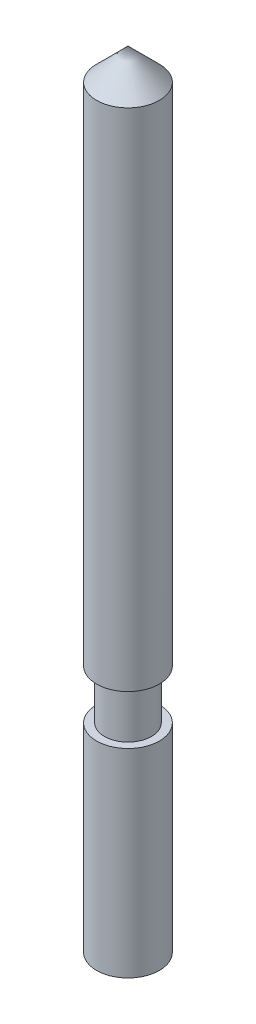
ISO-10303-21;
HEADER;
FILE_DESCRIPTION(('STEP AP214'),'2;1');
FILE_NAME('part.step','',(''),(''),'','','');
FILE_SCHEMA(('AUTOMOTIVE_DESIGN { 1 0 10303 214 1 1 1 1 }'));
ENDSEC;
DATA;
#1=APPLICATION_CONTEXT('core data for automotive mechanical design processes');
#2=APPLICATION_PROTOCOL_DEFINITION('international standard','automotive_design',2000,#1);
#3=PRODUCT_CONTEXT('',#1,'mechanical');
#4=PRODUCT('Part','Part','',(#3));
#5=PRODUCT_RELATED_PRODUCT_CATEGORY('part','',(#4));
#6=PRODUCT_DEFINITION_FORMATION('','',#4);
#7=PRODUCT_DEFINITION_CONTEXT('part definition',#1,'design');
#8=PRODUCT_DEFINITION('design','',#6,#7);
#9=PRODUCT_DEFINITION_SHAPE('','',#8);
#10=(LENGTH_UNIT() NAMED_UNIT(*) SI_UNIT(.MILLI.,.METRE.));
#11=(NAMED_UNIT(*) PLANE_ANGLE_UNIT() SI_UNIT($,.RADIAN.));
#12=(NAMED_UNIT(*) SI_UNIT($,.STERADIAN.) SOLID_ANGLE_UNIT());
#13=UNCERTAINTY_MEASURE_WITH_UNIT(LENGTH_MEASURE(1.E-05),#10,'distance_accuracy_value','');
#14=(GEOMETRIC_REPRESENTATION_CONTEXT(3) GLOBAL_UNCERTAINTY_ASSIGNED_CONTEXT((#13)) GLOBAL_UNIT_ASSIGNED_CONTEXT((#10,
#11,#12)) REPRESENTATION_CONTEXT('',''));
#15=CARTESIAN_POINT('',(0.,0.,0.));
#16=DIRECTION('',(0.,0.,1.));
#17=DIRECTION('',(1.,0.,0.));
#18=AXIS2_PLACEMENT_3D('',#15,#16,#17);
#19=CARTESIAN_POINT('',(-0.999999999999994,-10.3602928232736,0.));
#20=DIRECTION('',(0.,-1.,0.));
#21=DIRECTION('',(0.,0.,-1.));
#22=AXIS2_PLACEMENT_3D('',#19,#20,#21);
#23=PLANE('',#22);
#24=CARTESIAN_POINT('',(0.,-10.3602928232736,0.));
#25=DIRECTION('',(0.,1.,0.));
#26=DIRECTION('',(0.,0.,1.));
#27=AXIS2_PLACEMENT_3D('',#24,#25,#26);
#28=CIRCLE('',#27,0.999999999999994);
#29=CARTESIAN_POINT('',(0.,-10.3602928232736,0.999999999999994));
#30=VERTEX_POINT('',#29);
#31=EDGE_CURVE('E11',#30,#30,#28,.T.);
#32=ORIENTED_EDGE('',*,*,#31,.F.);
#33=EDGE_LOOP('',(#32));
#34=FACE_BOUND('',#33,.T.);
#35=ADVANCED_FACE('F33',(#34),#23,.T.);
#36=CARTESIAN_POINT('',(0.,20.7325865525957,0.));
#37=DIRECTION('',(0.,1.,0.));
#38=DIRECTION('',(0.,0.,1.));
#39=AXIS2_PLACEMENT_3D('',#36,#37,#38);
#40=CYLINDRICAL_SURFACE('',#39,0.999999999999994);
#41=ORIENTED_EDGE('',*,*,#31,.T.);
#42=EDGE_LOOP('',(#41));
#43=FACE_BOUND('',#42,.T.);
#44=CARTESIAN_POINT('',(0.,-4.03029282327361,0.));
#45=DIRECTION('',(0.,1.,0.));
#46=DIRECTION('',(0.,0.,1.));
#47=AXIS2_PLACEMENT_3D('',#44,#45,#46);
#48=CIRCLE('',#47,0.999999999999995);
#49=CARTESIAN_POINT('',(0.,-4.03029282327361,0.999999999999995));
#50=VERTEX_POINT('',#49);
#51=EDGE_CURVE('E39',#50,#50,#48,.T.);
#52=ORIENTED_EDGE('',*,*,#51,.F.);
#53=EDGE_LOOP('',(#52));
#54=FACE_BOUND('',#53,.T.);
#55=ADVANCED_FACE('F55',(#43,#54),#40,.T.);
#56=CARTESIAN_POINT('',(-0.749999999999996,-4.03029282327361,0.));
#57=DIRECTION('',(0.,1.,0.));
#58=DIRECTION('',(0.,0.,1.));
#59=AXIS2_PLACEMENT_3D('',#56,#57,#58);
#60=PLANE('',#59);
#61=ORIENTED_EDGE('',*,*,#51,.T.);
#62=EDGE_LOOP('',(#61));
#63=FACE_BOUND('',#62,.T.);
#64=CARTESIAN_POINT('',(0.,-4.03029282327361,0.));
#65=DIRECTION('',(0.,1.,0.));
#66=DIRECTION('',(0.,0.,1.));
#67=AXIS2_PLACEMENT_3D('',#64,#65,#66);
#68=CIRCLE('',#67,0.749999999999996);
#69=CARTESIAN_POINT('',(0.,-4.03029282327361,0.749999999999996));
#70=VERTEX_POINT('',#69);
#71=EDGE_CURVE('E67',#70,#70,#68,.T.);
#72=ORIENTED_EDGE('',*,*,#71,.F.);
#73=EDGE_LOOP('',(#72));
#74=FACE_BOUND('',#73,.T.);
#75=ADVANCED_FACE('F60',(#63,#74),#60,.T.);
#76=CARTESIAN_POINT('',(0.,20.7325865525957,0.));
#77=DIRECTION('',(0.,1.,0.));
#78=DIRECTION('',(0.,0.,1.));
#79=AXIS2_PLACEMENT_3D('',#76,#77,#78);
#80=CYLINDRICAL_SURFACE('',#79,0.749999999999996);
#81=ORIENTED_EDGE('',*,*,#71,.T.);
#82=EDGE_LOOP('',(#81));
#83=FACE_BOUND('',#82,.T.);
#84=CARTESIAN_POINT('',(0.,-2.46029282327361,0.));
#85=DIRECTION('',(0.,1.,0.));
#86=DIRECTION('',(0.,0.,1.));
#87=AXIS2_PLACEMENT_3D('',#84,#85,#86);
#88=CIRCLE('',#87,0.749999999999996);
#89=CARTESIAN_POINT('',(0.,-2.46029282327361,0.749999999999996));
#90=VERTEX_POINT('',#89);
#91=EDGE_CURVE('E69',#90,#90,#88,.T.);
#92=ORIENTED_EDGE('',*,*,#91,.F.);
#93=EDGE_LOOP('',(#92));
#94=FACE_BOUND('',#93,.T.);
#95=ADVANCED_FACE('F83',(#83,#94),#80,.T.);
#96=CARTESIAN_POINT('',(-0.999999999999994,-2.46029282327361,0.));
#97=DIRECTION('',(0.,-1.,0.));
#98=DIRECTION('',(0.,0.,-1.));
#99=AXIS2_PLACEMENT_3D('',#96,#97,#98);
#100=PLANE('',#99);
#101=ORIENTED_EDGE('',*,*,#91,.T.);
#102=EDGE_LOOP('',(#101));
#103=FACE_BOUND('',#102,.T.);
#104=CARTESIAN_POINT('',(0.,-2.46029282327361,0.));
#105=DIRECTION('',(0.,1.,0.));
#106=DIRECTION('',(0.,0.,1.));
#107=AXIS2_PLACEMENT_3D('',#104,#105,#106);
#108=CIRCLE('',#107,0.999999999999994);
#109=CARTESIAN_POINT('',(0.,-2.46029282327361,0.999999999999994));
#110=VERTEX_POINT('',#109);
#111=EDGE_CURVE('E74',#110,#110,#108,.T.);
#112=ORIENTED_EDGE('',*,*,#111,.F.);
#113=EDGE_LOOP('',(#112));
#114=FACE_BOUND('',#113,.T.);
#115=ADVANCED_FACE('F50',(#103,#114),#100,.T.);
#116=CARTESIAN_POINT('',(0.,20.7325865525957,0.));
#117=DIRECTION('',(0.,1.,0.));
#118=DIRECTION('',(0.,0.,1.));
#119=AXIS2_PLACEMENT_3D('',#116,#117,#118);
#120=CYLINDRICAL_SURFACE('',#119,0.999999999999997);
#121=ORIENTED_EDGE('',*,*,#111,.T.);
#122=EDGE_LOOP('',(#121));
#123=FACE_BOUND('',#122,.T.);
#124=CARTESIAN_POINT('',(0.,13.6397071767264,0.));
#125=DIRECTION('',(0.,1.,0.));
#126=DIRECTION('',(0.,0.,1.));
#127=AXIS2_PLACEMENT_3D('',#124,#125,#126);
#128=CIRCLE('',#127,1.);
#129=CARTESIAN_POINT('',(0.,13.6397071767264,1.));
#130=VERTEX_POINT('',#129);
#131=EDGE_CURVE('E77',#130,#130,#128,.T.);
#132=ORIENTED_EDGE('',*,*,#131,.F.);
#133=EDGE_LOOP('',(#132));
#134=FACE_BOUND('',#133,.T.);
#135=ADVANCED_FACE('F44',(#123,#134),#120,.T.);
#136=CARTESIAN_POINT('',(0.,14.6397071767264,0.));
#137=DIRECTION('',(0.,-1.,0.));
#138=DIRECTION('',(0.,0.,-1.));
#139=AXIS2_PLACEMENT_3D('',#136,#137,#138);
#140=CONICAL_SURFACE('',#139,0.,0.785398163397439);
#141=ORIENTED_EDGE('',*,*,#131,.T.);
#142=EDGE_LOOP('',(#141));
#143=FACE_BOUND('',#142,.T.);
#144=CARTESIAN_POINT('',(0.,14.6397071767264,0.));
#145=VERTEX_POINT('',#144);
#146=VERTEX_LOOP('',#145);
#147=FACE_BOUND('',#146,.T.);
#148=ADVANCED_FACE('F42',(#143,#147),#140,.T.);
#149=CLOSED_SHELL('',(#35,#55,#75,#95,#115,#135,#148));
#150=MANIFOLD_SOLID_BREP('B2',#149);
#151=ADVANCED_BREP_SHAPE_REPRESENTATION('',(#18,#150),#14);
#152=SHAPE_DEFINITION_REPRESENTATION(#9,#151);
ENDSEC;
END-ISO-10303-21;
